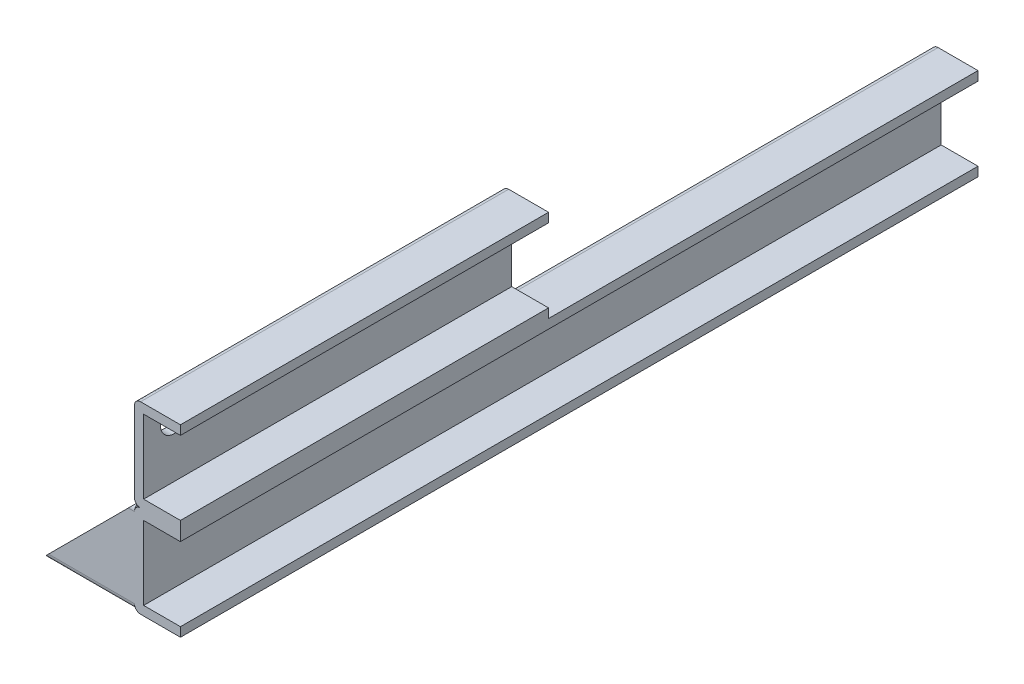
ISO-10303-21;
HEADER;
FILE_DESCRIPTION(('STEP AP214'),'2;1');
FILE_NAME('part.step','',(''),(''),'','','');
FILE_SCHEMA(('AUTOMOTIVE_DESIGN { 1 0 10303 214 1 1 1 1 }'));
ENDSEC;
DATA;
#1=APPLICATION_CONTEXT('core data for automotive mechanical design processes');
#2=APPLICATION_PROTOCOL_DEFINITION('international standard','automotive_design',2000,#1);
#3=PRODUCT_CONTEXT('',#1,'mechanical');
#4=PRODUCT('Part','Part','',(#3));
#5=PRODUCT_RELATED_PRODUCT_CATEGORY('part','',(#4));
#6=PRODUCT_DEFINITION_FORMATION('','',#4);
#7=PRODUCT_DEFINITION_CONTEXT('part definition',#1,'design');
#8=PRODUCT_DEFINITION('design','',#6,#7);
#9=PRODUCT_DEFINITION_SHAPE('','',#8);
#10=(LENGTH_UNIT() NAMED_UNIT(*) SI_UNIT(.MILLI.,.METRE.));
#11=(NAMED_UNIT(*) PLANE_ANGLE_UNIT() SI_UNIT($,.RADIAN.));
#12=(NAMED_UNIT(*) SI_UNIT($,.STERADIAN.) SOLID_ANGLE_UNIT());
#13=UNCERTAINTY_MEASURE_WITH_UNIT(LENGTH_MEASURE(1.E-05),#10,'distance_accuracy_value','');
#14=(GEOMETRIC_REPRESENTATION_CONTEXT(3) GLOBAL_UNCERTAINTY_ASSIGNED_CONTEXT((#13)) GLOBAL_UNIT_ASSIGNED_CONTEXT((#10,
#11,#12)) REPRESENTATION_CONTEXT('',''));
#15=CARTESIAN_POINT('',(0.,0.,0.));
#16=DIRECTION('',(0.,0.,1.));
#17=DIRECTION('',(1.,0.,0.));
#18=AXIS2_PLACEMENT_3D('',#15,#16,#17);
#19=CARTESIAN_POINT('',(-15.,15.,130.));
#20=DIRECTION('',(1.,0.,0.));
#21=DIRECTION('',(0.,1.,0.));
#22=AXIS2_PLACEMENT_3D('',#19,#20,#21);
#23=PLANE('',#22);
#24=DIRECTION('',(0.,-1.,0.));
#25=VECTOR('',#24,1.);
#26=CARTESIAN_POINT('',(-15.,-13.,100.));
#27=LINE('',#26,#25);
#28=CARTESIAN_POINT('',(-15.,13.,100.));
#29=VERTEX_POINT('',#28);
#30=CARTESIAN_POINT('',(-15.,-13.,100.));
#31=VERTEX_POINT('',#30);
#32=EDGE_CURVE('E491',#29,#31,#27,.T.);
#33=ORIENTED_EDGE('',*,*,#32,.F.);
#34=DIRECTION('',(0.,0.,-1.));
#35=VECTOR('',#34,1.);
#36=CARTESIAN_POINT('',(-15.,13.,130.));
#37=LINE('',#36,#35);
#38=CARTESIAN_POINT('',(-15.,13.,-130.));
#39=VERTEX_POINT('',#38);
#40=EDGE_CURVE('E398',#29,#39,#37,.T.);
#41=ORIENTED_EDGE('',*,*,#40,.T.);
#42=DIRECTION('',(0.,-1.,0.));
#43=VECTOR('',#42,1.);
#44=CARTESIAN_POINT('',(-15.,15.,-130.));
#45=LINE('',#44,#43);
#46=CARTESIAN_POINT('',(-15.,-13.,-130.));
#47=VERTEX_POINT('',#46);
#48=EDGE_CURVE('E327',#39,#47,#45,.T.);
#49=ORIENTED_EDGE('',*,*,#48,.T.);
#50=DIRECTION('',(0.,0.,-1.));
#51=VECTOR('',#50,1.);
#52=CARTESIAN_POINT('',(-15.,-13.,130.));
#53=LINE('',#52,#51);
#54=EDGE_CURVE('E402',#47,#31,#53,.F.);
#55=ORIENTED_EDGE('',*,*,#54,.T.);
#56=EDGE_LOOP('',(#33,#41,#49,#55));
#57=FACE_BOUND('',#56,.T.);
#58=ADVANCED_FACE('F33',(#57),#23,.F.);
#59=CARTESIAN_POINT('',(-15.,-15.,130.));
#60=DIRECTION('',(0.,1.,0.));
#61=DIRECTION('',(0.,0.,1.));
#62=AXIS2_PLACEMENT_3D('',#59,#60,#61);
#63=PLANE('',#62);
#64=DIRECTION('',(1.,0.,0.));
#65=VECTOR('',#64,1.);
#66=CARTESIAN_POINT('',(-15.,-15.,130.));
#67=LINE('',#66,#65);
#68=CARTESIAN_POINT('',(-13.,-15.,130.));
#69=VERTEX_POINT('',#68);
#70=CARTESIAN_POINT('',(0.,-15.,130.));
#71=VERTEX_POINT('',#70);
#72=EDGE_CURVE('E344',#69,#71,#67,.T.);
#73=ORIENTED_EDGE('',*,*,#72,.F.);
#74=DIRECTION('',(0.,0.,-1.));
#75=VECTOR('',#74,1.);
#76=CARTESIAN_POINT('',(-13.,-15.,130.));
#77=LINE('',#76,#75);
#78=CARTESIAN_POINT('',(-13.,-15.,-130.));
#79=VERTEX_POINT('',#78);
#80=EDGE_CURVE('E391',#69,#79,#77,.T.);
#81=ORIENTED_EDGE('',*,*,#80,.T.);
#82=DIRECTION('',(1.,0.,0.));
#83=VECTOR('',#82,1.);
#84=CARTESIAN_POINT('',(-15.,-15.,-130.));
#85=LINE('',#84,#83);
#86=CARTESIAN_POINT('',(0.,-15.,-130.));
#87=VERTEX_POINT('',#86);
#88=EDGE_CURVE('E360',#79,#87,#85,.T.);
#89=ORIENTED_EDGE('',*,*,#88,.T.);
#90=DIRECTION('',(0.,0.,-1.));
#91=VECTOR('',#90,1.);
#92=CARTESIAN_POINT('',(0.,-15.,130.));
#93=LINE('',#92,#91);
#94=EDGE_CURVE('E388',#71,#87,#93,.T.);
#95=ORIENTED_EDGE('',*,*,#94,.F.);
#96=EDGE_LOOP('',(#73,#81,#89,#95));
#97=FACE_BOUND('',#96,.T.);
#98=ADVANCED_FACE('F573',(#97),#63,.F.);
#99=CARTESIAN_POINT('',(0.,-15.,130.));
#100=DIRECTION('',(-1.,0.,0.));
#101=DIRECTION('',(0.,0.,1.));
#102=AXIS2_PLACEMENT_3D('',#99,#100,#101);
#103=PLANE('',#102);
#104=DIRECTION('',(0.,1.,0.));
#105=VECTOR('',#104,1.);
#106=CARTESIAN_POINT('',(0.,-15.,-130.));
#107=LINE('',#106,#105);
#108=CARTESIAN_POINT('',(0.,-12.,-130.));
#109=VERTEX_POINT('',#108);
#110=EDGE_CURVE('E362',#87,#109,#107,.T.);
#111=ORIENTED_EDGE('',*,*,#110,.T.);
#112=DIRECTION('',(0.,0.,-1.));
#113=VECTOR('',#112,1.);
#114=CARTESIAN_POINT('',(0.,-12.,130.));
#115=LINE('',#114,#113);
#116=CARTESIAN_POINT('',(0.,-12.,130.));
#117=VERTEX_POINT('',#116);
#118=EDGE_CURVE('E385',#117,#109,#115,.T.);
#119=ORIENTED_EDGE('',*,*,#118,.F.);
#120=DIRECTION('',(0.,1.,0.));
#121=VECTOR('',#120,1.);
#122=CARTESIAN_POINT('',(0.,-15.,130.));
#123=LINE('',#122,#121);
#124=EDGE_CURVE('E346',#71,#117,#123,.T.);
#125=ORIENTED_EDGE('',*,*,#124,.F.);
#126=ORIENTED_EDGE('',*,*,#94,.T.);
#127=EDGE_LOOP('',(#111,#119,#125,#126));
#128=FACE_BOUND('',#127,.T.);
#129=ADVANCED_FACE('F578',(#128),#103,.F.);
#130=CARTESIAN_POINT('',(-12.,-12.,130.));
#131=DIRECTION('',(0.,-1.,0.));
#132=DIRECTION('',(0.,0.,-1.));
#133=AXIS2_PLACEMENT_3D('',#130,#131,#132);
#134=PLANE('',#133);
#135=DIRECTION('',(-1.,0.,0.));
#136=VECTOR('',#135,1.);
#137=CARTESIAN_POINT('',(-12.,-12.,-130.));
#138=LINE('',#137,#136);
#139=CARTESIAN_POINT('',(-12.,-12.,-130.));
#140=VERTEX_POINT('',#139);
#141=EDGE_CURVE('E364',#109,#140,#138,.T.);
#142=ORIENTED_EDGE('',*,*,#141,.T.);
#143=DIRECTION('',(0.,0.,-1.));
#144=VECTOR('',#143,1.);
#145=CARTESIAN_POINT('',(-12.,-12.,130.));
#146=LINE('',#145,#144);
#147=CARTESIAN_POINT('',(-12.,-12.,130.));
#148=VERTEX_POINT('',#147);
#149=EDGE_CURVE('E382',#148,#140,#146,.T.);
#150=ORIENTED_EDGE('',*,*,#149,.F.);
#151=DIRECTION('',(-1.,0.,0.));
#152=VECTOR('',#151,1.);
#153=CARTESIAN_POINT('',(-12.,-12.,130.));
#154=LINE('',#153,#152);
#155=EDGE_CURVE('E349',#117,#148,#154,.T.);
#156=ORIENTED_EDGE('',*,*,#155,.F.);
#157=ORIENTED_EDGE('',*,*,#118,.T.);
#158=EDGE_LOOP('',(#142,#150,#156,#157));
#159=FACE_BOUND('',#158,.T.);
#160=ADVANCED_FACE('F653',(#159),#134,.F.);
#161=CARTESIAN_POINT('',(-12.,12.,130.));
#162=DIRECTION('',(-1.,0.,0.));
#163=DIRECTION('',(0.,-1.,0.));
#164=AXIS2_PLACEMENT_3D('',#161,#162,#163);
#165=PLANE('',#164);
#166=DIRECTION('',(0.,1.,0.));
#167=VECTOR('',#166,1.);
#168=CARTESIAN_POINT('',(-12.,12.,-130.));
#169=LINE('',#168,#167);
#170=CARTESIAN_POINT('',(-12.,12.,-130.));
#171=VERTEX_POINT('',#170);
#172=EDGE_CURVE('E366',#140,#171,#169,.T.);
#173=ORIENTED_EDGE('',*,*,#172,.T.);
#174=DIRECTION('',(0.,0.,-1.));
#175=VECTOR('',#174,1.);
#176=CARTESIAN_POINT('',(-12.,12.,130.));
#177=LINE('',#176,#175);
#178=CARTESIAN_POINT('',(-12.,12.,130.));
#179=VERTEX_POINT('',#178);
#180=EDGE_CURVE('E379',#179,#171,#177,.T.);
#181=ORIENTED_EDGE('',*,*,#180,.F.);
#182=DIRECTION('',(0.,1.,0.));
#183=VECTOR('',#182,1.);
#184=CARTESIAN_POINT('',(-12.,12.,130.));
#185=LINE('',#184,#183);
#186=EDGE_CURVE('E351',#148,#179,#185,.T.);
#187=ORIENTED_EDGE('',*,*,#186,.F.);
#188=ORIENTED_EDGE('',*,*,#149,.T.);
#189=EDGE_LOOP('',(#173,#181,#187,#188));
#190=FACE_BOUND('',#189,.T.);
#191=ADVANCED_FACE('F649',(#190),#165,.F.);
#192=CARTESIAN_POINT('',(-12.,12.,130.));
#193=DIRECTION('',(0.,1.,0.));
#194=DIRECTION('',(0.,0.,1.));
#195=AXIS2_PLACEMENT_3D('',#192,#193,#194);
#196=PLANE('',#195);
#197=DIRECTION('',(1.,0.,0.));
#198=VECTOR('',#197,1.);
#199=CARTESIAN_POINT('',(-12.,12.,-130.));
#200=LINE('',#199,#198);
#201=CARTESIAN_POINT('',(0.,12.,-130.));
#202=VERTEX_POINT('',#201);
#203=EDGE_CURVE('E368',#171,#202,#200,.T.);
#204=ORIENTED_EDGE('',*,*,#203,.T.);
#205=DIRECTION('',(0.,0.,-1.));
#206=VECTOR('',#205,1.);
#207=CARTESIAN_POINT('',(0.,12.,130.));
#208=LINE('',#207,#206);
#209=CARTESIAN_POINT('',(0.,12.,130.));
#210=VERTEX_POINT('',#209);
#211=EDGE_CURVE('E376',#210,#202,#208,.T.);
#212=ORIENTED_EDGE('',*,*,#211,.F.);
#213=DIRECTION('',(1.,0.,0.));
#214=VECTOR('',#213,1.);
#215=CARTESIAN_POINT('',(-12.,12.,130.));
#216=LINE('',#215,#214);
#217=EDGE_CURVE('E353',#179,#210,#216,.T.);
#218=ORIENTED_EDGE('',*,*,#217,.F.);
#219=ORIENTED_EDGE('',*,*,#180,.T.);
#220=EDGE_LOOP('',(#204,#212,#218,#219));
#221=FACE_BOUND('',#220,.T.);
#222=ADVANCED_FACE('F646',(#221),#196,.F.);
#223=CARTESIAN_POINT('',(0.,12.,130.));
#224=DIRECTION('',(-1.,0.,0.));
#225=DIRECTION('',(0.,0.,1.));
#226=AXIS2_PLACEMENT_3D('',#223,#224,#225);
#227=PLANE('',#226);
#228=DIRECTION('',(0.,1.,0.));
#229=VECTOR('',#228,1.);
#230=CARTESIAN_POINT('',(0.,12.,-130.));
#231=LINE('',#230,#229);
#232=CARTESIAN_POINT('',(0.,15.,-130.));
#233=VERTEX_POINT('',#232);
#234=EDGE_CURVE('E370',#202,#233,#231,.T.);
#235=ORIENTED_EDGE('',*,*,#234,.T.);
#236=DIRECTION('',(0.,0.,-1.));
#237=VECTOR('',#236,1.);
#238=CARTESIAN_POINT('',(0.,15.,130.));
#239=LINE('',#238,#237);
#240=CARTESIAN_POINT('',(0.,15.,10.));
#241=VERTEX_POINT('',#240);
#242=EDGE_CURVE('E357',#241,#233,#239,.T.);
#243=ORIENTED_EDGE('',*,*,#242,.F.);
#244=DIRECTION('',(0.,1.,0.));
#245=VECTOR('',#244,1.);
#246=CARTESIAN_POINT('',(0.,15.,10.));
#247=LINE('',#246,#245);
#248=CARTESIAN_POINT('',(0.,18.,10.));
#249=VERTEX_POINT('',#248);
#250=EDGE_CURVE('E270',#241,#249,#247,.T.);
#251=ORIENTED_EDGE('',*,*,#250,.T.);
#252=DIRECTION('',(0.,0.,1.));
#253=VECTOR('',#252,1.);
#254=CARTESIAN_POINT('',(0.,18.,10.));
#255=LINE('',#254,#253);
#256=CARTESIAN_POINT('',(0.,18.,130.));
#257=VERTEX_POINT('',#256);
#258=EDGE_CURVE('E300',#249,#257,#255,.T.);
#259=ORIENTED_EDGE('',*,*,#258,.T.);
#260=DIRECTION('',(0.,1.,0.));
#261=VECTOR('',#260,1.);
#262=CARTESIAN_POINT('',(0.,12.,130.));
#263=LINE('',#262,#261);
#264=EDGE_CURVE('E355',#210,#257,#263,.T.);
#265=ORIENTED_EDGE('',*,*,#264,.F.);
#266=ORIENTED_EDGE('',*,*,#211,.T.);
#267=EDGE_LOOP('',(#235,#243,#251,#259,#265,#266));
#268=FACE_BOUND('',#267,.T.);
#269=ADVANCED_FACE('F440',(#268),#227,.F.);
#270=CARTESIAN_POINT('',(-15.,15.,130.));
#271=DIRECTION('',(0.,-1.,0.));
#272=DIRECTION('',(0.,0.,-1.));
#273=AXIS2_PLACEMENT_3D('',#270,#271,#272);
#274=PLANE('',#273);
#275=DIRECTION('',(0.,0.,-1.));
#276=VECTOR('',#275,1.);
#277=CARTESIAN_POINT('',(-13.,15.,130.));
#278=LINE('',#277,#276);
#279=CARTESIAN_POINT('',(-13.,15.,-130.));
#280=VERTEX_POINT('',#279);
#281=CARTESIAN_POINT('',(-13.,15.,10.));
#282=VERTEX_POINT('',#281);
#283=EDGE_CURVE('E41',#280,#282,#278,.F.);
#284=ORIENTED_EDGE('',*,*,#283,.T.);
#285=DIRECTION('',(1.,0.,0.));
#286=VECTOR('',#285,1.);
#287=CARTESIAN_POINT('',(-13.,15.,10.));
#288=LINE('',#287,#286);
#289=EDGE_CURVE('E298',#282,#241,#288,.T.);
#290=ORIENTED_EDGE('',*,*,#289,.T.);
#291=ORIENTED_EDGE('',*,*,#242,.T.);
#292=DIRECTION('',(-1.,0.,0.));
#293=VECTOR('',#292,1.);
#294=CARTESIAN_POINT('',(-15.,15.,-130.));
#295=LINE('',#294,#293);
#296=EDGE_CURVE('E347',#233,#280,#295,.T.);
#297=ORIENTED_EDGE('',*,*,#296,.T.);
#298=EDGE_LOOP('',(#284,#290,#291,#297));
#299=FACE_BOUND('',#298,.T.);
#300=ADVANCED_FACE('F444',(#299),#274,.F.);
#301=CARTESIAN_POINT('',(0.,0.,130.));
#302=DIRECTION('',(0.,0.,1.));
#303=DIRECTION('',(1.,0.,0.));
#304=AXIS2_PLACEMENT_3D('',#301,#302,#303);
#305=PLANE('',#304);
#306=DIRECTION('',(0.707106781186547,0.707106781186548,0.));
#307=VECTOR('',#306,1.);
#308=CARTESIAN_POINT('',(-45.,-15.,130.));
#309=LINE('',#308,#307);
#310=CARTESIAN_POINT('',(-43.,-13.,130.));
#311=VERTEX_POINT('',#310);
#312=CARTESIAN_POINT('',(-17.,13.,130.));
#313=VERTEX_POINT('',#312);
#314=EDGE_CURVE('E223',#311,#313,#309,.T.);
#315=ORIENTED_EDGE('',*,*,#314,.F.);
#316=DIRECTION('',(1.,0.,0.));
#317=VECTOR('',#316,1.);
#318=CARTESIAN_POINT('',(-45.,-13.,130.));
#319=LINE('',#318,#317);
#320=CARTESIAN_POINT('',(-15.,-13.,130.));
#321=VERTEX_POINT('',#320);
#322=EDGE_CURVE('E236',#311,#321,#319,.T.);
#323=ORIENTED_EDGE('',*,*,#322,.T.);
#324=CARTESIAN_POINT('',(-13.,-13.,130.));
#325=DIRECTION('',(0.,0.,1.));
#326=DIRECTION('',(1.,0.,0.));
#327=AXIS2_PLACEMENT_3D('',#324,#325,#326);
#328=CIRCLE('',#327,2.);
#329=EDGE_CURVE('E407',#321,#69,#328,.T.);
#330=ORIENTED_EDGE('',*,*,#329,.T.);
#331=ORIENTED_EDGE('',*,*,#72,.T.);
#332=ORIENTED_EDGE('',*,*,#124,.T.);
#333=ORIENTED_EDGE('',*,*,#155,.T.);
#334=ORIENTED_EDGE('',*,*,#186,.T.);
#335=ORIENTED_EDGE('',*,*,#217,.T.);
#336=ORIENTED_EDGE('',*,*,#264,.T.);
#337=DIRECTION('',(-1.,0.,0.));
#338=VECTOR('',#337,1.);
#339=CARTESIAN_POINT('',(0.,18.,130.));
#340=LINE('',#339,#338);
#341=CARTESIAN_POINT('',(-12.,18.,130.));
#342=VERTEX_POINT('',#341);
#343=EDGE_CURVE('E301',#257,#342,#340,.T.);
#344=ORIENTED_EDGE('',*,*,#343,.T.);
#345=DIRECTION('',(0.,1.,0.));
#346=VECTOR('',#345,1.);
#347=CARTESIAN_POINT('',(-12.,18.,130.));
#348=LINE('',#347,#346);
#349=CARTESIAN_POINT('',(-12.,42.,130.));
#350=VERTEX_POINT('',#349);
#351=EDGE_CURVE('E304',#342,#350,#348,.T.);
#352=ORIENTED_EDGE('',*,*,#351,.T.);
#353=DIRECTION('',(1.,0.,0.));
#354=VECTOR('',#353,1.);
#355=CARTESIAN_POINT('',(-12.,42.,130.));
#356=LINE('',#355,#354);
#357=CARTESIAN_POINT('',(0.,42.,130.));
#358=VERTEX_POINT('',#357);
#359=EDGE_CURVE('E307',#350,#358,#356,.T.);
#360=ORIENTED_EDGE('',*,*,#359,.T.);
#361=DIRECTION('',(0.,1.,0.));
#362=VECTOR('',#361,1.);
#363=CARTESIAN_POINT('',(0.,42.,130.));
#364=LINE('',#363,#362);
#365=CARTESIAN_POINT('',(0.,45.,130.));
#366=VERTEX_POINT('',#365);
#367=EDGE_CURVE('E310',#358,#366,#364,.T.);
#368=ORIENTED_EDGE('',*,*,#367,.T.);
#369=DIRECTION('',(-1.,0.,0.));
#370=VECTOR('',#369,1.);
#371=CARTESIAN_POINT('',(0.,45.,130.));
#372=LINE('',#371,#370);
#373=CARTESIAN_POINT('',(-13.,45.,130.));
#374=VERTEX_POINT('',#373);
#375=EDGE_CURVE('E313',#366,#374,#372,.T.);
#376=ORIENTED_EDGE('',*,*,#375,.T.);
#377=CARTESIAN_POINT('',(-13.,43.,130.));
#378=DIRECTION('',(0.,0.,1.));
#379=DIRECTION('',(-1.,0.,0.));
#380=AXIS2_PLACEMENT_3D('',#377,#378,#379);
#381=CIRCLE('',#380,2.);
#382=CARTESIAN_POINT('',(-15.,43.,130.));
#383=VERTEX_POINT('',#382);
#384=EDGE_CURVE('E316',#374,#383,#381,.T.);
#385=ORIENTED_EDGE('',*,*,#384,.T.);
#386=DIRECTION('',(0.,-1.,0.));
#387=VECTOR('',#386,1.);
#388=CARTESIAN_POINT('',(-15.,43.,130.));
#389=LINE('',#388,#387);
#390=CARTESIAN_POINT('',(-15.,17.,130.));
#391=VERTEX_POINT('',#390);
#392=EDGE_CURVE('E319',#383,#391,#389,.T.);
#393=ORIENTED_EDGE('',*,*,#392,.T.);
#394=CARTESIAN_POINT('',(-13.,17.,130.));
#395=DIRECTION('',(0.,0.,1.));
#396=DIRECTION('',(1.,0.,0.));
#397=AXIS2_PLACEMENT_3D('',#394,#395,#396);
#398=CIRCLE('',#397,2.);
#399=CARTESIAN_POINT('',(-13.,15.,130.));
#400=VERTEX_POINT('',#399);
#401=EDGE_CURVE('E274',#391,#400,#398,.T.);
#402=ORIENTED_EDGE('',*,*,#401,.T.);
#403=CARTESIAN_POINT('',(-13.,13.,130.));
#404=DIRECTION('',(0.,0.,1.));
#405=DIRECTION('',(1.,0.,0.));
#406=AXIS2_PLACEMENT_3D('',#403,#404,#405);
#407=CIRCLE('',#406,2.);
#408=CARTESIAN_POINT('',(-15.,13.,130.));
#409=VERTEX_POINT('',#408);
#410=EDGE_CURVE('E405',#400,#409,#407,.T.);
#411=ORIENTED_EDGE('',*,*,#410,.T.);
#412=DIRECTION('',(1.,0.,0.));
#413=VECTOR('',#412,1.);
#414=CARTESIAN_POINT('',(-45.,13.,130.));
#415=LINE('',#414,#413);
#416=EDGE_CURVE('E239',#313,#409,#415,.T.);
#417=ORIENTED_EDGE('',*,*,#416,.F.);
#418=EDGE_LOOP('',(#315,#323,#330,#331,#332,#333,#334,#335,#336,#344,#352,#360,#368,#376,#385,
#393,#402,#411,#417));
#419=FACE_BOUND('',#418,.T.);
#420=ADVANCED_FACE('F235',(#419),#305,.T.);
#421=CARTESIAN_POINT('',(0.,0.,-130.));
#422=DIRECTION('',(0.,0.,1.));
#423=DIRECTION('',(1.,0.,0.));
#424=AXIS2_PLACEMENT_3D('',#421,#422,#423);
#425=PLANE('',#424);
#426=ORIENTED_EDGE('',*,*,#88,.F.);
#427=CARTESIAN_POINT('',(-13.,-13.,-130.));
#428=DIRECTION('',(0.,0.,1.));
#429=DIRECTION('',(1.,0.,0.));
#430=AXIS2_PLACEMENT_3D('',#427,#428,#429);
#431=CIRCLE('',#430,2.);
#432=EDGE_CURVE('E396',#79,#47,#431,.F.);
#433=ORIENTED_EDGE('',*,*,#432,.T.);
#434=ORIENTED_EDGE('',*,*,#48,.F.);
#435=CARTESIAN_POINT('',(-13.,13.,-130.));
#436=DIRECTION('',(0.,0.,1.));
#437=DIRECTION('',(1.,0.,0.));
#438=AXIS2_PLACEMENT_3D('',#435,#436,#437);
#439=CIRCLE('',#438,2.);
#440=EDGE_CURVE('E394',#39,#280,#439,.F.);
#441=ORIENTED_EDGE('',*,*,#440,.T.);
#442=ORIENTED_EDGE('',*,*,#296,.F.);
#443=ORIENTED_EDGE('',*,*,#234,.F.);
#444=ORIENTED_EDGE('',*,*,#203,.F.);
#445=ORIENTED_EDGE('',*,*,#172,.F.);
#446=ORIENTED_EDGE('',*,*,#141,.F.);
#447=ORIENTED_EDGE('',*,*,#110,.F.);
#448=EDGE_LOOP('',(#426,#433,#434,#441,#442,#443,#444,#445,#446,#447));
#449=FACE_BOUND('',#448,.T.);
#450=ADVANCED_FACE('F638',(#449),#425,.F.);
#451=CARTESIAN_POINT('',(-13.,-13.,130.));
#452=DIRECTION('',(0.,0.,-1.));
#453=DIRECTION('',(-1.,0.,0.));
#454=AXIS2_PLACEMENT_3D('',#451,#452,#453);
#455=CYLINDRICAL_SURFACE('',#454,2.);
#456=ORIENTED_EDGE('',*,*,#329,.F.);
#457=DIRECTION('',(0.,0.,-1.));
#458=VECTOR('',#457,1.);
#459=CARTESIAN_POINT('',(-15.,-13.,130.));
#460=LINE('',#459,#458);
#461=EDGE_CURVE('E259',#31,#321,#460,.F.);
#462=ORIENTED_EDGE('',*,*,#461,.F.);
#463=ORIENTED_EDGE('',*,*,#54,.F.);
#464=ORIENTED_EDGE('',*,*,#432,.F.);
#465=ORIENTED_EDGE('',*,*,#80,.F.);
#466=EDGE_LOOP('',(#456,#462,#463,#464,#465));
#467=FACE_BOUND('',#466,.T.);
#468=ADVANCED_FACE('F507',(#467),#455,.T.);
#469=CARTESIAN_POINT('',(-13.,13.,130.));
#470=DIRECTION('',(0.,0.,-1.));
#471=DIRECTION('',(-1.,0.,0.));
#472=AXIS2_PLACEMENT_3D('',#469,#470,#471);
#473=CYLINDRICAL_SURFACE('',#472,2.);
#474=ORIENTED_EDGE('',*,*,#410,.F.);
#475=DIRECTION('',(0.,0.,1.));
#476=VECTOR('',#475,1.);
#477=CARTESIAN_POINT('',(-13.,15.,10.));
#478=LINE('',#477,#476);
#479=EDGE_CURVE('E324',#282,#400,#478,.T.);
#480=ORIENTED_EDGE('',*,*,#479,.F.);
#481=ORIENTED_EDGE('',*,*,#283,.F.);
#482=ORIENTED_EDGE('',*,*,#440,.F.);
#483=ORIENTED_EDGE('',*,*,#40,.F.);
#484=EDGE_CURVE('E399',#409,#29,#37,.T.);
#485=ORIENTED_EDGE('',*,*,#484,.F.);
#486=EDGE_LOOP('',(#474,#480,#481,#482,#483,#485));
#487=FACE_BOUND('',#486,.T.);
#488=ADVANCED_FACE('F35',(#487),#473,.T.);
#489=CARTESIAN_POINT('',(-13.,17.,10.));
#490=DIRECTION('',(0.,0.,1.));
#491=DIRECTION('',(1.,0.,0.));
#492=AXIS2_PLACEMENT_3D('',#489,#490,#491);
#493=CYLINDRICAL_SURFACE('',#492,2.);
#494=ORIENTED_EDGE('',*,*,#401,.F.);
#495=DIRECTION('',(0.,0.,1.));
#496=VECTOR('',#495,1.);
#497=CARTESIAN_POINT('',(-15.,17.,10.));
#498=LINE('',#497,#496);
#499=CARTESIAN_POINT('',(-15.,17.,10.));
#500=VERTEX_POINT('',#499);
#501=EDGE_CURVE('E328',#500,#391,#498,.T.);
#502=ORIENTED_EDGE('',*,*,#501,.F.);
#503=CARTESIAN_POINT('',(-13.,17.,10.));
#504=DIRECTION('',(0.,0.,1.));
#505=DIRECTION('',(1.,0.,0.));
#506=AXIS2_PLACEMENT_3D('',#503,#504,#505);
#507=CIRCLE('',#506,2.);
#508=EDGE_CURVE('E295',#500,#282,#507,.T.);
#509=ORIENTED_EDGE('',*,*,#508,.T.);
#510=ORIENTED_EDGE('',*,*,#479,.T.);
#511=EDGE_LOOP('',(#494,#502,#509,#510));
#512=FACE_BOUND('',#511,.T.);
#513=ADVANCED_FACE('F467',(#512),#493,.T.);
#514=CARTESIAN_POINT('',(-15.,43.,10.));
#515=DIRECTION('',(-1.,0.,0.));
#516=DIRECTION('',(0.,-1.,0.));
#517=AXIS2_PLACEMENT_3D('',#514,#515,#516);
#518=PLANE('',#517);
#519=CARTESIAN_POINT('',(-15.,36.,20.));
#520=DIRECTION('',(-1.,0.,0.));
#521=DIRECTION('',(0.,-1.,0.));
#522=AXIS2_PLACEMENT_3D('',#519,#520,#521);
#523=CIRCLE('',#522,4.50000000000001);
#524=CARTESIAN_POINT('',(-15.,31.5,20.));
#525=VERTEX_POINT('',#524);
#526=EDGE_CURVE('E262',#525,#525,#523,.T.);
#527=ORIENTED_EDGE('',*,*,#526,.F.);
#528=EDGE_LOOP('',(#527));
#529=FACE_BOUND('',#528,.T.);
#530=CARTESIAN_POINT('',(-15.,36.,120.));
#531=DIRECTION('',(-1.,0.,0.));
#532=DIRECTION('',(0.,-1.,0.));
#533=AXIS2_PLACEMENT_3D('',#530,#531,#532);
#534=CIRCLE('',#533,4.49999999999998);
#535=CARTESIAN_POINT('',(-15.,31.5,120.));
#536=VERTEX_POINT('',#535);
#537=EDGE_CURVE('E266',#536,#536,#534,.T.);
#538=ORIENTED_EDGE('',*,*,#537,.F.);
#539=EDGE_LOOP('',(#538));
#540=FACE_BOUND('',#539,.T.);
#541=ORIENTED_EDGE('',*,*,#392,.F.);
#542=DIRECTION('',(0.,0.,1.));
#543=VECTOR('',#542,1.);
#544=CARTESIAN_POINT('',(-15.,43.,10.));
#545=LINE('',#544,#543);
#546=CARTESIAN_POINT('',(-15.,43.,10.));
#547=VERTEX_POINT('',#546);
#548=EDGE_CURVE('E330',#547,#383,#545,.T.);
#549=ORIENTED_EDGE('',*,*,#548,.F.);
#550=DIRECTION('',(0.,-1.,0.));
#551=VECTOR('',#550,1.);
#552=CARTESIAN_POINT('',(-15.,43.,10.));
#553=LINE('',#552,#551);
#554=EDGE_CURVE('E292',#547,#500,#553,.T.);
#555=ORIENTED_EDGE('',*,*,#554,.T.);
#556=ORIENTED_EDGE('',*,*,#501,.T.);
#557=EDGE_LOOP('',(#541,#549,#555,#556));
#558=FACE_BOUND('',#557,.T.);
#559=ADVANCED_FACE('F452',(#529,#540,#558),#518,.T.);
#560=CARTESIAN_POINT('',(-13.,43.,10.));
#561=DIRECTION('',(0.,0.,1.));
#562=DIRECTION('',(1.,0.,0.));
#563=AXIS2_PLACEMENT_3D('',#560,#561,#562);
#564=CYLINDRICAL_SURFACE('',#563,2.);
#565=ORIENTED_EDGE('',*,*,#384,.F.);
#566=DIRECTION('',(0.,0.,1.));
#567=VECTOR('',#566,1.);
#568=CARTESIAN_POINT('',(-13.,45.,10.));
#569=LINE('',#568,#567);
#570=CARTESIAN_POINT('',(-13.,45.,10.));
#571=VERTEX_POINT('',#570);
#572=EDGE_CURVE('E332',#571,#374,#569,.T.);
#573=ORIENTED_EDGE('',*,*,#572,.F.);
#574=CARTESIAN_POINT('',(-13.,43.,10.));
#575=DIRECTION('',(0.,0.,1.));
#576=DIRECTION('',(-1.,0.,0.));
#577=AXIS2_PLACEMENT_3D('',#574,#575,#576);
#578=CIRCLE('',#577,2.);
#579=EDGE_CURVE('E289',#571,#547,#578,.T.);
#580=ORIENTED_EDGE('',*,*,#579,.T.);
#581=ORIENTED_EDGE('',*,*,#548,.T.);
#582=EDGE_LOOP('',(#565,#573,#580,#581));
#583=FACE_BOUND('',#582,.T.);
#584=ADVANCED_FACE('F456',(#583),#564,.T.);
#585=CARTESIAN_POINT('',(0.,45.,10.));
#586=DIRECTION('',(0.,1.,0.));
#587=DIRECTION('',(-1.,0.,0.));
#588=AXIS2_PLACEMENT_3D('',#585,#586,#587);
#589=PLANE('',#588);
#590=ORIENTED_EDGE('',*,*,#375,.F.);
#591=DIRECTION('',(0.,0.,1.));
#592=VECTOR('',#591,1.);
#593=CARTESIAN_POINT('',(0.,45.,10.));
#594=LINE('',#593,#592);
#595=CARTESIAN_POINT('',(0.,45.,10.));
#596=VERTEX_POINT('',#595);
#597=EDGE_CURVE('E334',#596,#366,#594,.T.);
#598=ORIENTED_EDGE('',*,*,#597,.F.);
#599=DIRECTION('',(-1.,0.,0.));
#600=VECTOR('',#599,1.);
#601=CARTESIAN_POINT('',(0.,45.,10.));
#602=LINE('',#601,#600);
#603=EDGE_CURVE('E286',#596,#571,#602,.T.);
#604=ORIENTED_EDGE('',*,*,#603,.T.);
#605=ORIENTED_EDGE('',*,*,#572,.T.);
#606=EDGE_LOOP('',(#590,#598,#604,#605));
#607=FACE_BOUND('',#606,.T.);
#608=ADVANCED_FACE('F461',(#607),#589,.T.);
#609=CARTESIAN_POINT('',(0.,42.,10.));
#610=DIRECTION('',(1.,0.,0.));
#611=DIRECTION('',(0.,1.,0.));
#612=AXIS2_PLACEMENT_3D('',#609,#610,#611);
#613=PLANE('',#612);
#614=ORIENTED_EDGE('',*,*,#367,.F.);
#615=DIRECTION('',(0.,0.,1.));
#616=VECTOR('',#615,1.);
#617=CARTESIAN_POINT('',(0.,42.,10.));
#618=LINE('',#617,#616);
#619=CARTESIAN_POINT('',(0.,42.,10.));
#620=VERTEX_POINT('',#619);
#621=EDGE_CURVE('E336',#620,#358,#618,.T.);
#622=ORIENTED_EDGE('',*,*,#621,.F.);
#623=DIRECTION('',(0.,1.,0.));
#624=VECTOR('',#623,1.);
#625=CARTESIAN_POINT('',(0.,42.,10.));
#626=LINE('',#625,#624);
#627=EDGE_CURVE('E283',#620,#596,#626,.T.);
#628=ORIENTED_EDGE('',*,*,#627,.T.);
#629=ORIENTED_EDGE('',*,*,#597,.T.);
#630=EDGE_LOOP('',(#614,#622,#628,#629));
#631=FACE_BOUND('',#630,.T.);
#632=ADVANCED_FACE('F464',(#631),#613,.T.);
#633=CARTESIAN_POINT('',(-12.,42.,10.));
#634=DIRECTION('',(0.,-1.,0.));
#635=DIRECTION('',(1.,0.,0.));
#636=AXIS2_PLACEMENT_3D('',#633,#634,#635);
#637=PLANE('',#636);
#638=ORIENTED_EDGE('',*,*,#359,.F.);
#639=DIRECTION('',(0.,0.,1.));
#640=VECTOR('',#639,1.);
#641=CARTESIAN_POINT('',(-12.,42.,10.));
#642=LINE('',#641,#640);
#643=CARTESIAN_POINT('',(-12.,42.,10.));
#644=VERTEX_POINT('',#643);
#645=EDGE_CURVE('E338',#644,#350,#642,.T.);
#646=ORIENTED_EDGE('',*,*,#645,.F.);
#647=DIRECTION('',(1.,0.,0.));
#648=VECTOR('',#647,1.);
#649=CARTESIAN_POINT('',(-12.,42.,10.));
#650=LINE('',#649,#648);
#651=EDGE_CURVE('E280',#644,#620,#650,.T.);
#652=ORIENTED_EDGE('',*,*,#651,.T.);
#653=ORIENTED_EDGE('',*,*,#621,.T.);
#654=EDGE_LOOP('',(#638,#646,#652,#653));
#655=FACE_BOUND('',#654,.T.);
#656=ADVANCED_FACE('F422',(#655),#637,.T.);
#657=CARTESIAN_POINT('',(-12.,18.,10.));
#658=DIRECTION('',(1.,0.,0.));
#659=DIRECTION('',(0.,1.,0.));
#660=AXIS2_PLACEMENT_3D('',#657,#658,#659);
#661=PLANE('',#660);
#662=CARTESIAN_POINT('',(-12.,36.,20.));
#663=DIRECTION('',(1.,0.,0.));
#664=DIRECTION('',(0.,1.,0.));
#665=AXIS2_PLACEMENT_3D('',#662,#663,#664);
#666=CIRCLE('',#665,4.50000000000001);
#667=CARTESIAN_POINT('',(-12.,40.5,20.));
#668=VERTEX_POINT('',#667);
#669=EDGE_CURVE('E265',#668,#668,#666,.T.);
#670=ORIENTED_EDGE('',*,*,#669,.F.);
#671=EDGE_LOOP('',(#670));
#672=FACE_BOUND('',#671,.T.);
#673=CARTESIAN_POINT('',(-12.,36.,120.));
#674=DIRECTION('',(1.,0.,0.));
#675=DIRECTION('',(0.,1.,0.));
#676=AXIS2_PLACEMENT_3D('',#673,#674,#675);
#677=CIRCLE('',#676,4.49999999999998);
#678=CARTESIAN_POINT('',(-12.,40.5,120.));
#679=VERTEX_POINT('',#678);
#680=EDGE_CURVE('E269',#679,#679,#677,.T.);
#681=ORIENTED_EDGE('',*,*,#680,.F.);
#682=EDGE_LOOP('',(#681));
#683=FACE_BOUND('',#682,.T.);
#684=ORIENTED_EDGE('',*,*,#351,.F.);
#685=DIRECTION('',(0.,0.,1.));
#686=VECTOR('',#685,1.);
#687=CARTESIAN_POINT('',(-12.,18.,10.));
#688=LINE('',#687,#686);
#689=CARTESIAN_POINT('',(-12.,18.,10.));
#690=VERTEX_POINT('',#689);
#691=EDGE_CURVE('E340',#690,#342,#688,.T.);
#692=ORIENTED_EDGE('',*,*,#691,.F.);
#693=DIRECTION('',(0.,1.,0.));
#694=VECTOR('',#693,1.);
#695=CARTESIAN_POINT('',(-12.,18.,10.));
#696=LINE('',#695,#694);
#697=EDGE_CURVE('E277',#690,#644,#696,.T.);
#698=ORIENTED_EDGE('',*,*,#697,.T.);
#699=ORIENTED_EDGE('',*,*,#645,.T.);
#700=EDGE_LOOP('',(#684,#692,#698,#699));
#701=FACE_BOUND('',#700,.T.);
#702=ADVANCED_FACE('F418',(#672,#683,#701),#661,.T.);
#703=CARTESIAN_POINT('',(0.,18.,10.));
#704=DIRECTION('',(0.,1.,0.));
#705=DIRECTION('',(0.,0.,1.));
#706=AXIS2_PLACEMENT_3D('',#703,#704,#705);
#707=PLANE('',#706);
#708=ORIENTED_EDGE('',*,*,#343,.F.);
#709=ORIENTED_EDGE('',*,*,#258,.F.);
#710=DIRECTION('',(-1.,0.,0.));
#711=VECTOR('',#710,1.);
#712=CARTESIAN_POINT('',(0.,18.,10.));
#713=LINE('',#712,#711);
#714=EDGE_CURVE('E273',#249,#690,#713,.T.);
#715=ORIENTED_EDGE('',*,*,#714,.T.);
#716=ORIENTED_EDGE('',*,*,#691,.T.);
#717=EDGE_LOOP('',(#708,#709,#715,#716));
#718=FACE_BOUND('',#717,.T.);
#719=ADVANCED_FACE('F421',(#718),#707,.T.);
#720=CARTESIAN_POINT('',(-13.,43.,10.));
#721=DIRECTION('',(0.,0.,-1.));
#722=DIRECTION('',(-1.,0.,0.));
#723=AXIS2_PLACEMENT_3D('',#720,#721,#722);
#724=PLANE('',#723);
#725=ORIENTED_EDGE('',*,*,#250,.F.);
#726=ORIENTED_EDGE('',*,*,#289,.F.);
#727=ORIENTED_EDGE('',*,*,#508,.F.);
#728=ORIENTED_EDGE('',*,*,#554,.F.);
#729=ORIENTED_EDGE('',*,*,#579,.F.);
#730=ORIENTED_EDGE('',*,*,#603,.F.);
#731=ORIENTED_EDGE('',*,*,#627,.F.);
#732=ORIENTED_EDGE('',*,*,#651,.F.);
#733=ORIENTED_EDGE('',*,*,#697,.F.);
#734=ORIENTED_EDGE('',*,*,#714,.F.);
#735=EDGE_LOOP('',(#725,#726,#727,#728,#729,#730,#731,#732,#733,#734));
#736=FACE_BOUND('',#735,.T.);
#737=ADVANCED_FACE('F435',(#736),#724,.T.);
#738=CARTESIAN_POINT('',(4.99999999999999,36.,120.));
#739=DIRECTION('',(-1.,0.,0.));
#740=DIRECTION('',(0.,-1.,0.));
#741=AXIS2_PLACEMENT_3D('',#738,#739,#740);
#742=CYLINDRICAL_SURFACE('',#741,4.49999999999998);
#743=ORIENTED_EDGE('',*,*,#680,.T.);
#744=EDGE_LOOP('',(#743));
#745=FACE_BOUND('',#744,.T.);
#746=ORIENTED_EDGE('',*,*,#537,.T.);
#747=EDGE_LOOP('',(#746));
#748=FACE_BOUND('',#747,.T.);
#749=ADVANCED_FACE('F610',(#745,#748),#742,.F.);
#750=CARTESIAN_POINT('',(4.99999999999999,36.,20.));
#751=DIRECTION('',(-1.,0.,0.));
#752=DIRECTION('',(0.,-1.,0.));
#753=AXIS2_PLACEMENT_3D('',#750,#751,#752);
#754=CYLINDRICAL_SURFACE('',#753,4.50000000000001);
#755=ORIENTED_EDGE('',*,*,#669,.T.);
#756=EDGE_LOOP('',(#755));
#757=FACE_BOUND('',#756,.T.);
#758=ORIENTED_EDGE('',*,*,#526,.T.);
#759=EDGE_LOOP('',(#758));
#760=FACE_BOUND('',#759,.T.);
#761=ADVANCED_FACE('F415',(#757,#760),#754,.F.);
#762=CARTESIAN_POINT('',(-15.,13.,128.));
#763=DIRECTION('',(-1.,0.,0.));
#764=DIRECTION('',(0.,-1.,0.));
#765=AXIS2_PLACEMENT_3D('',#762,#763,#764);
#766=PLANE('',#765);
#767=CARTESIAN_POINT('',(-15.,-13.,102.));
#768=DIRECTION('',(-1.,0.,0.));
#769=DIRECTION('',(0.,1.,0.));
#770=AXIS2_PLACEMENT_3D('',#767,#768,#769);
#771=CIRCLE('',#770,2.);
#772=CARTESIAN_POINT('',(-15.,-15.,102.));
#773=VERTEX_POINT('',#772);
#774=EDGE_CURVE('E494',#31,#773,#771,.T.);
#775=ORIENTED_EDGE('',*,*,#774,.F.);
#776=ORIENTED_EDGE('',*,*,#461,.T.);
#777=CARTESIAN_POINT('',(-15.,-13.,128.));
#778=DIRECTION('',(-1.,0.,0.));
#779=DIRECTION('',(0.,-1.,0.));
#780=AXIS2_PLACEMENT_3D('',#777,#778,#779);
#781=CIRCLE('',#780,2.);
#782=CARTESIAN_POINT('',(-15.,-15.,128.));
#783=VERTEX_POINT('',#782);
#784=EDGE_CURVE('E245',#783,#321,#781,.T.);
#785=ORIENTED_EDGE('',*,*,#784,.F.);
#786=DIRECTION('',(0.,0.,1.));
#787=VECTOR('',#786,1.);
#788=CARTESIAN_POINT('',(-15.,-15.,128.));
#789=LINE('',#788,#787);
#790=EDGE_CURVE('E496',#773,#783,#789,.T.);
#791=ORIENTED_EDGE('',*,*,#790,.F.);
#792=EDGE_LOOP('',(#775,#776,#785,#791));
#793=FACE_BOUND('',#792,.T.);
#794=ADVANCED_FACE('F503',(#793),#766,.F.);
#795=ORIENTED_EDGE('',*,*,#484,.T.);
#796=CARTESIAN_POINT('',(-15.,13.,102.));
#797=DIRECTION('',(-1.,0.,0.));
#798=DIRECTION('',(0.,-1.,0.));
#799=AXIS2_PLACEMENT_3D('',#796,#797,#798);
#800=CIRCLE('',#799,2.);
#801=CARTESIAN_POINT('',(-15.,15.,102.));
#802=VERTEX_POINT('',#801);
#803=EDGE_CURVE('E484',#802,#29,#800,.T.);
#804=ORIENTED_EDGE('',*,*,#803,.F.);
#805=DIRECTION('',(0.,0.,-1.));
#806=VECTOR('',#805,1.);
#807=CARTESIAN_POINT('',(-15.,15.,128.));
#808=LINE('',#807,#806);
#809=CARTESIAN_POINT('',(-15.,15.,128.));
#810=VERTEX_POINT('',#809);
#811=EDGE_CURVE('E480',#810,#802,#808,.T.);
#812=ORIENTED_EDGE('',*,*,#811,.F.);
#813=CARTESIAN_POINT('',(-15.,13.,128.));
#814=DIRECTION('',(-1.,0.,0.));
#815=DIRECTION('',(0.,-1.,0.));
#816=AXIS2_PLACEMENT_3D('',#813,#814,#815);
#817=CIRCLE('',#816,2.);
#818=EDGE_CURVE('E478',#409,#810,#817,.T.);
#819=ORIENTED_EDGE('',*,*,#818,.F.);
#820=EDGE_LOOP('',(#795,#804,#812,#819));
#821=FACE_BOUND('',#820,.T.);
#822=ADVANCED_FACE('F479',(#821),#766,.F.);
#823=CARTESIAN_POINT('',(-45.,13.,128.));
#824=DIRECTION('',(1.,0.,0.));
#825=DIRECTION('',(0.,1.,0.));
#826=AXIS2_PLACEMENT_3D('',#823,#824,#825);
#827=CYLINDRICAL_SURFACE('',#826,2.);
#828=ORIENTED_EDGE('',*,*,#818,.T.);
#829=CARTESIAN_POINT('',(-17.,13.,128.));
#830=DIRECTION('',(0.707106781186548,-0.707106781186547,0.));
#831=DIRECTION('',(0.707106781186547,0.707106781186548,0.));
#832=AXIS2_PLACEMENT_3D('',#829,#830,#831);
#833=ELLIPSE('',#832,2.82842712474619,2.);
#834=EDGE_CURVE('E521',#810,#313,#833,.T.);
#835=ORIENTED_EDGE('',*,*,#834,.T.);
#836=ORIENTED_EDGE('',*,*,#416,.T.);
#837=EDGE_LOOP('',(#828,#835,#836));
#838=FACE_BOUND('',#837,.T.);
#839=ADVANCED_FACE('F601',(#838),#827,.T.);
#840=CARTESIAN_POINT('',(-45.,13.,102.));
#841=DIRECTION('',(1.,0.,0.));
#842=DIRECTION('',(0.,1.,0.));
#843=AXIS2_PLACEMENT_3D('',#840,#841,#842);
#844=CYLINDRICAL_SURFACE('',#843,2.);
#845=DIRECTION('',(1.,0.,0.));
#846=VECTOR('',#845,1.);
#847=CARTESIAN_POINT('',(-45.,13.,100.));
#848=LINE('',#847,#846);
#849=CARTESIAN_POINT('',(-17.,13.,100.));
#850=VERTEX_POINT('',#849);
#851=EDGE_CURVE('E257',#850,#29,#848,.T.);
#852=ORIENTED_EDGE('',*,*,#851,.F.);
#853=CARTESIAN_POINT('',(-17.,13.,102.));
#854=DIRECTION('',(0.707106781186548,-0.707106781186547,0.));
#855=DIRECTION('',(0.707106781186547,0.707106781186548,0.));
#856=AXIS2_PLACEMENT_3D('',#853,#854,#855);
#857=ELLIPSE('',#856,2.82842712474619,2.);
#858=EDGE_CURVE('E520',#850,#802,#857,.T.);
#859=ORIENTED_EDGE('',*,*,#858,.T.);
#860=ORIENTED_EDGE('',*,*,#803,.T.);
#861=EDGE_LOOP('',(#852,#859,#860));
#862=FACE_BOUND('',#861,.T.);
#863=ADVANCED_FACE('F519',(#862),#844,.T.);
#864=CARTESIAN_POINT('',(-45.,-13.,100.));
#865=DIRECTION('',(0.,0.,1.));
#866=DIRECTION('',(1.,0.,0.));
#867=AXIS2_PLACEMENT_3D('',#864,#865,#866);
#868=PLANE('',#867);
#869=DIRECTION('',(1.,0.,0.));
#870=VECTOR('',#869,1.);
#871=CARTESIAN_POINT('',(-45.,-13.,100.));
#872=LINE('',#871,#870);
#873=CARTESIAN_POINT('',(-43.,-13.,100.));
#874=VERTEX_POINT('',#873);
#875=EDGE_CURVE('E255',#874,#31,#872,.T.);
#876=ORIENTED_EDGE('',*,*,#875,.F.);
#877=DIRECTION('',(0.707106781186547,0.707106781186548,0.));
#878=VECTOR('',#877,1.);
#879=CARTESIAN_POINT('',(-44.,-14.,100.));
#880=LINE('',#879,#878);
#881=EDGE_CURVE('E516',#874,#850,#880,.T.);
#882=ORIENTED_EDGE('',*,*,#881,.T.);
#883=ORIENTED_EDGE('',*,*,#851,.T.);
#884=ORIENTED_EDGE('',*,*,#32,.T.);
#885=EDGE_LOOP('',(#876,#882,#883,#884));
#886=FACE_BOUND('',#885,.T.);
#887=ADVANCED_FACE('F513',(#886),#868,.F.);
#888=CARTESIAN_POINT('',(-45.,-13.,102.));
#889=DIRECTION('',(1.,0.,0.));
#890=DIRECTION('',(0.,1.,0.));
#891=AXIS2_PLACEMENT_3D('',#888,#889,#890);
#892=CYLINDRICAL_SURFACE('',#891,2.);
#893=DIRECTION('',(1.,0.,0.));
#894=VECTOR('',#893,1.);
#895=CARTESIAN_POINT('',(-45.,-15.,102.));
#896=LINE('',#895,#894);
#897=CARTESIAN_POINT('',(-45.,-15.,102.));
#898=VERTEX_POINT('',#897);
#899=EDGE_CURVE('E248',#898,#773,#896,.T.);
#900=ORIENTED_EDGE('',*,*,#899,.F.);
#901=CARTESIAN_POINT('',(-43.,-13.,102.));
#902=DIRECTION('',(0.707106781186548,-0.707106781186547,0.));
#903=DIRECTION('',(0.707106781186547,0.707106781186548,0.));
#904=AXIS2_PLACEMENT_3D('',#901,#902,#903);
#905=ELLIPSE('',#904,2.82842712474619,2.);
#906=EDGE_CURVE('E231',#898,#874,#905,.T.);
#907=ORIENTED_EDGE('',*,*,#906,.T.);
#908=ORIENTED_EDGE('',*,*,#875,.T.);
#909=ORIENTED_EDGE('',*,*,#774,.T.);
#910=EDGE_LOOP('',(#900,#907,#908,#909));
#911=FACE_BOUND('',#910,.T.);
#912=ADVANCED_FACE('F563',(#911),#892,.T.);
#913=CARTESIAN_POINT('',(-45.,-15.,128.));
#914=DIRECTION('',(0.,1.,0.));
#915=DIRECTION('',(0.,0.,1.));
#916=AXIS2_PLACEMENT_3D('',#913,#914,#915);
#917=PLANE('',#916);
#918=ORIENTED_EDGE('',*,*,#790,.T.);
#919=DIRECTION('',(1.,0.,0.));
#920=VECTOR('',#919,1.);
#921=CARTESIAN_POINT('',(-45.,-15.,128.));
#922=LINE('',#921,#920);
#923=CARTESIAN_POINT('',(-45.,-15.,128.));
#924=VERTEX_POINT('',#923);
#925=EDGE_CURVE('E246',#924,#783,#922,.T.);
#926=ORIENTED_EDGE('',*,*,#925,.F.);
#927=DIRECTION('',(0.,0.,1.));
#928=VECTOR('',#927,1.);
#929=CARTESIAN_POINT('',(-45.,-15.,128.));
#930=LINE('',#929,#928);
#931=EDGE_CURVE('E226',#898,#924,#930,.T.);
#932=ORIENTED_EDGE('',*,*,#931,.F.);
#933=ORIENTED_EDGE('',*,*,#899,.T.);
#934=EDGE_LOOP('',(#918,#926,#932,#933));
#935=FACE_BOUND('',#934,.T.);
#936=ADVANCED_FACE('F499',(#935),#917,.F.);
#937=CARTESIAN_POINT('',(-45.,-13.,128.));
#938=DIRECTION('',(1.,0.,0.));
#939=DIRECTION('',(0.,1.,0.));
#940=AXIS2_PLACEMENT_3D('',#937,#938,#939);
#941=CYLINDRICAL_SURFACE('',#940,2.);
#942=ORIENTED_EDGE('',*,*,#322,.F.);
#943=CARTESIAN_POINT('',(-43.,-13.,128.));
#944=DIRECTION('',(0.707106781186548,-0.707106781186547,0.));
#945=DIRECTION('',(0.707106781186547,0.707106781186548,0.));
#946=AXIS2_PLACEMENT_3D('',#943,#944,#945);
#947=ELLIPSE('',#946,2.82842712474619,2.);
#948=EDGE_CURVE('E220',#311,#924,#947,.T.);
#949=ORIENTED_EDGE('',*,*,#948,.T.);
#950=ORIENTED_EDGE('',*,*,#925,.T.);
#951=ORIENTED_EDGE('',*,*,#784,.T.);
#952=EDGE_LOOP('',(#942,#949,#950,#951));
#953=FACE_BOUND('',#952,.T.);
#954=ADVANCED_FACE('F243',(#953),#941,.T.);
#955=CARTESIAN_POINT('',(-45.,-15.,80.));
#956=DIRECTION('',(0.707106781186548,-0.707106781186547,0.));
#957=DIRECTION('',(0.707106781186547,0.707106781186548,0.));
#958=AXIS2_PLACEMENT_3D('',#955,#956,#957);
#959=PLANE('',#958);
#960=DIRECTION('',(-0.707106781186547,-0.707106781186548,0.));
#961=VECTOR('',#960,1.);
#962=CARTESIAN_POINT('',(-43.5,-13.5,127.));
#963=LINE('',#962,#961);
#964=CARTESIAN_POINT('',(-18.,12.,127.));
#965=VERTEX_POINT('',#964);
#966=CARTESIAN_POINT('',(-42.,-12.,127.));
#967=VERTEX_POINT('',#966);
#968=EDGE_CURVE('E47',#965,#967,#963,.T.);
#969=ORIENTED_EDGE('',*,*,#968,.T.);
#970=DIRECTION('',(0.,0.,-1.));
#971=VECTOR('',#970,1.);
#972=CARTESIAN_POINT('',(-42.,-12.,127.));
#973=LINE('',#972,#971);
#974=CARTESIAN_POINT('',(-42.,-12.,103.));
#975=VERTEX_POINT('',#974);
#976=EDGE_CURVE('E11',#967,#975,#973,.T.);
#977=ORIENTED_EDGE('',*,*,#976,.T.);
#978=DIRECTION('',(0.707106781186547,0.707106781186548,0.));
#979=VECTOR('',#978,1.);
#980=CARTESIAN_POINT('',(-43.5,-13.5,103.));
#981=LINE('',#980,#979);
#982=CARTESIAN_POINT('',(-18.,12.,103.));
#983=VERTEX_POINT('',#982);
#984=EDGE_CURVE('E240',#975,#983,#981,.T.);
#985=ORIENTED_EDGE('',*,*,#984,.T.);
#986=DIRECTION('',(0.,0.,1.));
#987=VECTOR('',#986,1.);
#988=CARTESIAN_POINT('',(-18.,12.,127.));
#989=LINE('',#988,#987);
#990=EDGE_CURVE('E549',#983,#965,#989,.T.);
#991=ORIENTED_EDGE('',*,*,#990,.T.);
#992=EDGE_LOOP('',(#969,#977,#985,#991));
#993=FACE_BOUND('',#992,.T.);
#994=ORIENTED_EDGE('',*,*,#811,.T.);
#995=ORIENTED_EDGE('',*,*,#858,.F.);
#996=ORIENTED_EDGE('',*,*,#881,.F.);
#997=ORIENTED_EDGE('',*,*,#906,.F.);
#998=ORIENTED_EDGE('',*,*,#931,.T.);
#999=ORIENTED_EDGE('',*,*,#948,.F.);
#1000=ORIENTED_EDGE('',*,*,#314,.T.);
#1001=ORIENTED_EDGE('',*,*,#834,.F.);
#1002=EDGE_LOOP('',(#994,#995,#996,#997,#998,#999,#1000,#1001));
#1003=FACE_BOUND('',#1002,.T.);
#1004=ADVANCED_FACE('F222',(#993,#1003),#959,.F.);
#1005=DIRECTION('',(0.,0.,1.));
#1006=VECTOR('',#1005,1.);
#1007=CARTESIAN_POINT('',(-15.,-12.,127.));
#1008=LINE('',#1007,#1006);
#1009=CARTESIAN_POINT('',(-15.,-12.,103.));
#1010=VERTEX_POINT('',#1009);
#1011=CARTESIAN_POINT('',(-15.,-12.,127.));
#1012=VERTEX_POINT('',#1011);
#1013=EDGE_CURVE('E536',#1010,#1012,#1008,.T.);
#1014=ORIENTED_EDGE('',*,*,#1013,.T.);
#1015=DIRECTION('',(0.,1.,0.));
#1016=VECTOR('',#1015,1.);
#1017=CARTESIAN_POINT('',(-15.,-12.,127.));
#1018=LINE('',#1017,#1016);
#1019=CARTESIAN_POINT('',(-15.,12.,127.));
#1020=VERTEX_POINT('',#1019);
#1021=EDGE_CURVE('E523',#1012,#1020,#1018,.T.);
#1022=ORIENTED_EDGE('',*,*,#1021,.T.);
#1023=DIRECTION('',(0.,0.,-1.));
#1024=VECTOR('',#1023,1.);
#1025=CARTESIAN_POINT('',(-15.,12.,127.));
#1026=LINE('',#1025,#1024);
#1027=CARTESIAN_POINT('',(-15.,12.,103.));
#1028=VERTEX_POINT('',#1027);
#1029=EDGE_CURVE('E530',#1020,#1028,#1026,.T.);
#1030=ORIENTED_EDGE('',*,*,#1029,.T.);
#1031=DIRECTION('',(0.,-1.,0.));
#1032=VECTOR('',#1031,1.);
#1033=CARTESIAN_POINT('',(-15.,-12.,103.));
#1034=LINE('',#1033,#1032);
#1035=EDGE_CURVE('E533',#1028,#1010,#1034,.T.);
#1036=ORIENTED_EDGE('',*,*,#1035,.T.);
#1037=EDGE_LOOP('',(#1014,#1022,#1030,#1036));
#1038=FACE_BOUND('',#1037,.T.);
#1039=ADVANCED_FACE('F555',(#1038),#23,.F.);
#1040=CARTESIAN_POINT('',(-45.,-12.,127.));
#1041=DIRECTION('',(0.,1.,0.));
#1042=DIRECTION('',(-1.,0.,0.));
#1043=AXIS2_PLACEMENT_3D('',#1040,#1041,#1042);
#1044=PLANE('',#1043);
#1045=ORIENTED_EDGE('',*,*,#976,.F.);
#1046=DIRECTION('',(1.,0.,0.));
#1047=VECTOR('',#1046,1.);
#1048=CARTESIAN_POINT('',(-45.,-12.,127.));
#1049=LINE('',#1048,#1047);
#1050=EDGE_CURVE('E54',#967,#1012,#1049,.T.);
#1051=ORIENTED_EDGE('',*,*,#1050,.T.);
#1052=ORIENTED_EDGE('',*,*,#1013,.F.);
#1053=DIRECTION('',(1.,0.,0.));
#1054=VECTOR('',#1053,1.);
#1055=CARTESIAN_POINT('',(-45.,-12.,103.));
#1056=LINE('',#1055,#1054);
#1057=EDGE_CURVE('E540',#975,#1010,#1056,.T.);
#1058=ORIENTED_EDGE('',*,*,#1057,.F.);
#1059=EDGE_LOOP('',(#1045,#1051,#1052,#1058));
#1060=FACE_BOUND('',#1059,.T.);
#1061=ADVANCED_FACE('F582',(#1060),#1044,.T.);
#1062=CARTESIAN_POINT('',(-45.,-12.,103.));
#1063=DIRECTION('',(0.,0.,1.));
#1064=DIRECTION('',(1.,0.,0.));
#1065=AXIS2_PLACEMENT_3D('',#1062,#1063,#1064);
#1066=PLANE('',#1065);
#1067=ORIENTED_EDGE('',*,*,#984,.F.);
#1068=ORIENTED_EDGE('',*,*,#1057,.T.);
#1069=ORIENTED_EDGE('',*,*,#1035,.F.);
#1070=DIRECTION('',(1.,0.,0.));
#1071=VECTOR('',#1070,1.);
#1072=CARTESIAN_POINT('',(-45.,12.,103.));
#1073=LINE('',#1072,#1071);
#1074=EDGE_CURVE('E486',#983,#1028,#1073,.T.);
#1075=ORIENTED_EDGE('',*,*,#1074,.F.);
#1076=EDGE_LOOP('',(#1067,#1068,#1069,#1075));
#1077=FACE_BOUND('',#1076,.T.);
#1078=ADVANCED_FACE('F552',(#1077),#1066,.T.);
#1079=CARTESIAN_POINT('',(-45.,12.,127.));
#1080=DIRECTION('',(0.,-1.,0.));
#1081=DIRECTION('',(1.,0.,0.));
#1082=AXIS2_PLACEMENT_3D('',#1079,#1080,#1081);
#1083=PLANE('',#1082);
#1084=ORIENTED_EDGE('',*,*,#990,.F.);
#1085=ORIENTED_EDGE('',*,*,#1074,.T.);
#1086=ORIENTED_EDGE('',*,*,#1029,.F.);
#1087=DIRECTION('',(1.,0.,0.));
#1088=VECTOR('',#1087,1.);
#1089=CARTESIAN_POINT('',(-45.,12.,127.));
#1090=LINE('',#1089,#1088);
#1091=EDGE_CURVE('E482',#965,#1020,#1090,.T.);
#1092=ORIENTED_EDGE('',*,*,#1091,.F.);
#1093=EDGE_LOOP('',(#1084,#1085,#1086,#1092));
#1094=FACE_BOUND('',#1093,.T.);
#1095=ADVANCED_FACE('F547',(#1094),#1083,.T.);
#1096=CARTESIAN_POINT('',(-45.,-12.,127.));
#1097=DIRECTION('',(0.,0.,-1.));
#1098=DIRECTION('',(-1.,0.,0.));
#1099=AXIS2_PLACEMENT_3D('',#1096,#1097,#1098);
#1100=PLANE('',#1099);
#1101=ORIENTED_EDGE('',*,*,#968,.F.);
#1102=ORIENTED_EDGE('',*,*,#1091,.T.);
#1103=ORIENTED_EDGE('',*,*,#1021,.F.);
#1104=ORIENTED_EDGE('',*,*,#1050,.F.);
#1105=EDGE_LOOP('',(#1101,#1102,#1103,#1104));
#1106=FACE_BOUND('',#1105,.T.);
#1107=ADVANCED_FACE('F557',(#1106),#1100,.T.);
#1108=CLOSED_SHELL('',(#58,#98,#129,#160,#191,#222,#269,#300,#420,#450,#468,#488,#513,#559,#584,
#608,#632,#656,#702,#719,#737,#749,#761,#794,#822,#839,#863,#887,#912,#936,#954,#1004,#1039,
#1061,#1078,#1095,#1107));
#1109=MANIFOLD_SOLID_BREP('B2',#1108);
#1110=ADVANCED_BREP_SHAPE_REPRESENTATION('',(#18,#1109),#14);
#1111=SHAPE_DEFINITION_REPRESENTATION(#9,#1110);
ENDSEC;
END-ISO-10303-21;
